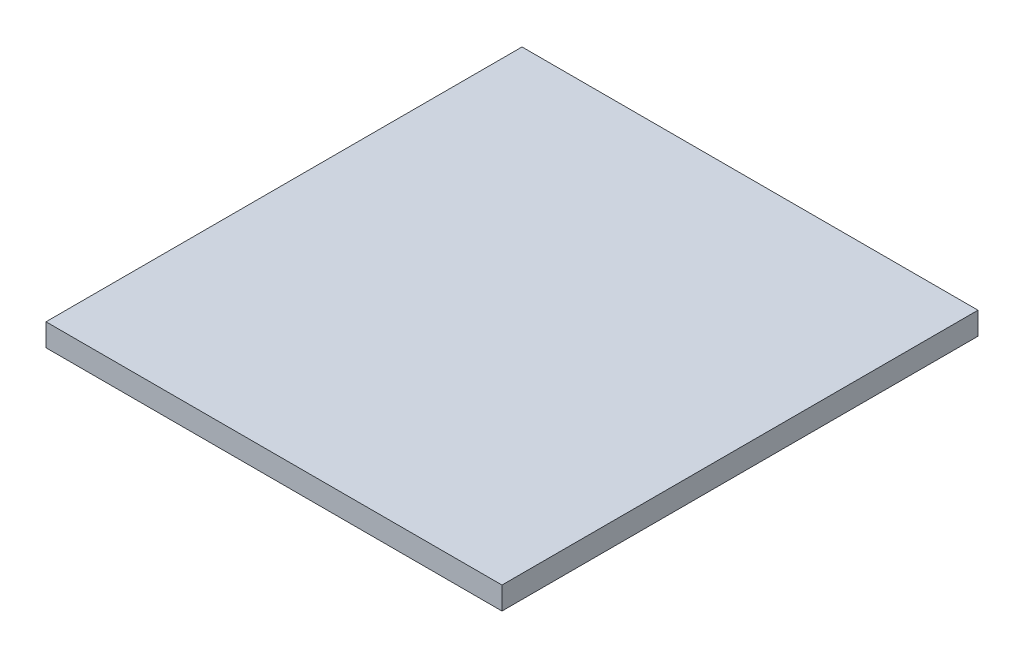
ISO-10303-21;
HEADER;
FILE_DESCRIPTION(('STEP AP214'),'2;1');
FILE_NAME('part.step','',(''),(''),'','','');
FILE_SCHEMA(('AUTOMOTIVE_DESIGN { 1 0 10303 214 1 1 1 1 }'));
ENDSEC;
DATA;
#1=APPLICATION_CONTEXT('core data for automotive mechanical design processes');
#2=APPLICATION_PROTOCOL_DEFINITION('international standard','automotive_design',2000,#1);
#3=PRODUCT_CONTEXT('',#1,'mechanical');
#4=PRODUCT('Part','Part','',(#3));
#5=PRODUCT_RELATED_PRODUCT_CATEGORY('part','',(#4));
#6=PRODUCT_DEFINITION_FORMATION('','',#4);
#7=PRODUCT_DEFINITION_CONTEXT('part definition',#1,'design');
#8=PRODUCT_DEFINITION('design','',#6,#7);
#9=PRODUCT_DEFINITION_SHAPE('','',#8);
#10=(LENGTH_UNIT() NAMED_UNIT(*) SI_UNIT(.MILLI.,.METRE.));
#11=(NAMED_UNIT(*) PLANE_ANGLE_UNIT() SI_UNIT($,.RADIAN.));
#12=(NAMED_UNIT(*) SI_UNIT($,.STERADIAN.) SOLID_ANGLE_UNIT());
#13=UNCERTAINTY_MEASURE_WITH_UNIT(LENGTH_MEASURE(1.E-05),#10,'distance_accuracy_value','');
#14=(GEOMETRIC_REPRESENTATION_CONTEXT(3) GLOBAL_UNCERTAINTY_ASSIGNED_CONTEXT((#13)) GLOBAL_UNIT_ASSIGNED_CONTEXT((#10,
#11,#12)) REPRESENTATION_CONTEXT('',''));
#15=CARTESIAN_POINT('',(0.,0.,0.));
#16=DIRECTION('',(0.,0.,1.));
#17=DIRECTION('',(1.,0.,0.));
#18=AXIS2_PLACEMENT_3D('',#15,#16,#17);
#19=CARTESIAN_POINT('',(325.575632917722,18.,17.0557139599908));
#20=DIRECTION('',(-1.,0.,0.));
#21=DIRECTION('',(0.,0.,1.));
#22=AXIS2_PLACEMENT_3D('',#19,#20,#21);
#23=PLANE('',#22);
#24=DIRECTION('',(0.,0.,-1.));
#25=VECTOR('',#24,1.);
#26=CARTESIAN_POINT('',(325.575632917722,0.,17.0557139599908));
#27=LINE('',#26,#25);
#28=CARTESIAN_POINT('',(325.575632917722,0.,17.0557139599908));
#29=VERTEX_POINT('',#28);
#30=CARTESIAN_POINT('',(325.575632917722,0.,-362.944286040009));
#31=VERTEX_POINT('',#30);
#32=EDGE_CURVE('E98',#29,#31,#27,.T.);
#33=ORIENTED_EDGE('',*,*,#32,.T.);
#34=DIRECTION('',(0.,-1.,0.));
#35=VECTOR('',#34,1.);
#36=CARTESIAN_POINT('',(325.575632917722,18.,-362.944286040009));
#37=LINE('',#36,#35);
#38=CARTESIAN_POINT('',(325.575632917722,18.,-362.944286040009));
#39=VERTEX_POINT('',#38);
#40=EDGE_CURVE('E11',#39,#31,#37,.T.);
#41=ORIENTED_EDGE('',*,*,#40,.F.);
#42=DIRECTION('',(0.,0.,-1.));
#43=VECTOR('',#42,1.);
#44=CARTESIAN_POINT('',(325.575632917722,18.,17.0557139599908));
#45=LINE('',#44,#43);
#46=CARTESIAN_POINT('',(325.575632917722,18.,17.0557139599908));
#47=VERTEX_POINT('',#46);
#48=EDGE_CURVE('E86',#47,#39,#45,.T.);
#49=ORIENTED_EDGE('',*,*,#48,.F.);
#50=DIRECTION('',(0.,-1.,0.));
#51=VECTOR('',#50,1.);
#52=CARTESIAN_POINT('',(325.575632917722,18.,17.0557139599908));
#53=LINE('',#52,#51);
#54=EDGE_CURVE('E94',#47,#29,#53,.T.);
#55=ORIENTED_EDGE('',*,*,#54,.T.);
#56=EDGE_LOOP('',(#33,#41,#49,#55));
#57=FACE_BOUND('',#56,.T.);
#58=ADVANCED_FACE('F35',(#57),#23,.F.);
#59=CARTESIAN_POINT('',(325.575632917722,18.,-362.944286040009));
#60=DIRECTION('',(0.,0.,1.));
#61=DIRECTION('',(1.,0.,0.));
#62=AXIS2_PLACEMENT_3D('',#59,#60,#61);
#63=PLANE('',#62);
#64=DIRECTION('',(-1.,0.,0.));
#65=VECTOR('',#64,1.);
#66=CARTESIAN_POINT('',(325.575632917722,0.,-362.944286040009));
#67=LINE('',#66,#65);
#68=CARTESIAN_POINT('',(-38.4243670822783,0.,-362.944286040009));
#69=VERTEX_POINT('',#68);
#70=EDGE_CURVE('E90',#31,#69,#67,.T.);
#71=ORIENTED_EDGE('',*,*,#70,.T.);
#72=DIRECTION('',(0.,-1.,0.));
#73=VECTOR('',#72,1.);
#74=CARTESIAN_POINT('',(-38.4243670822783,18.,-362.944286040009));
#75=LINE('',#74,#73);
#76=CARTESIAN_POINT('',(-38.4243670822783,18.,-362.944286040009));
#77=VERTEX_POINT('',#76);
#78=EDGE_CURVE('E43',#77,#69,#75,.T.);
#79=ORIENTED_EDGE('',*,*,#78,.F.);
#80=DIRECTION('',(-1.,0.,0.));
#81=VECTOR('',#80,1.);
#82=CARTESIAN_POINT('',(325.575632917722,18.,-362.944286040009));
#83=LINE('',#82,#81);
#84=EDGE_CURVE('E81',#39,#77,#83,.T.);
#85=ORIENTED_EDGE('',*,*,#84,.F.);
#86=ORIENTED_EDGE('',*,*,#40,.T.);
#87=EDGE_LOOP('',(#71,#79,#85,#86));
#88=FACE_BOUND('',#87,.T.);
#89=ADVANCED_FACE('F89',(#88),#63,.F.);
#90=CARTESIAN_POINT('',(-38.4243670822783,18.,17.0557139599909));
#91=DIRECTION('',(1.,0.,0.));
#92=DIRECTION('',(0.,0.,-1.));
#93=AXIS2_PLACEMENT_3D('',#90,#91,#92);
#94=PLANE('',#93);
#95=DIRECTION('',(0.,0.,1.));
#96=VECTOR('',#95,1.);
#97=CARTESIAN_POINT('',(-38.4243670822783,0.,17.0557139599909));
#98=LINE('',#97,#96);
#99=CARTESIAN_POINT('',(-38.4243670822783,0.,17.0557139599909));
#100=VERTEX_POINT('',#99);
#101=EDGE_CURVE('E68',#69,#100,#98,.T.);
#102=ORIENTED_EDGE('',*,*,#101,.T.);
#103=DIRECTION('',(0.,-1.,0.));
#104=VECTOR('',#103,1.);
#105=CARTESIAN_POINT('',(-38.4243670822783,18.,17.0557139599909));
#106=LINE('',#105,#104);
#107=CARTESIAN_POINT('',(-38.4243670822783,18.,17.0557139599909));
#108=VERTEX_POINT('',#107);
#109=EDGE_CURVE('E91',#108,#100,#106,.T.);
#110=ORIENTED_EDGE('',*,*,#109,.F.);
#111=DIRECTION('',(0.,0.,1.));
#112=VECTOR('',#111,1.);
#113=CARTESIAN_POINT('',(-38.4243670822783,18.,17.0557139599909));
#114=LINE('',#113,#112);
#115=EDGE_CURVE('E84',#77,#108,#114,.T.);
#116=ORIENTED_EDGE('',*,*,#115,.F.);
#117=ORIENTED_EDGE('',*,*,#78,.T.);
#118=EDGE_LOOP('',(#102,#110,#116,#117));
#119=FACE_BOUND('',#118,.T.);
#120=ADVANCED_FACE('F92',(#119),#94,.F.);
#121=CARTESIAN_POINT('',(325.575632917722,18.,17.0557139599908));
#122=DIRECTION('',(0.,0.,-1.));
#123=DIRECTION('',(-1.,0.,0.));
#124=AXIS2_PLACEMENT_3D('',#121,#122,#123);
#125=PLANE('',#124);
#126=DIRECTION('',(1.,0.,0.));
#127=VECTOR('',#126,1.);
#128=CARTESIAN_POINT('',(325.575632917722,0.,17.0557139599908));
#129=LINE('',#128,#127);
#130=EDGE_CURVE('E74',#100,#29,#129,.T.);
#131=ORIENTED_EDGE('',*,*,#130,.T.);
#132=ORIENTED_EDGE('',*,*,#54,.F.);
#133=DIRECTION('',(1.,0.,0.));
#134=VECTOR('',#133,1.);
#135=CARTESIAN_POINT('',(325.575632917722,18.,17.0557139599908));
#136=LINE('',#135,#134);
#137=EDGE_CURVE('E51',#108,#47,#136,.T.);
#138=ORIENTED_EDGE('',*,*,#137,.F.);
#139=ORIENTED_EDGE('',*,*,#109,.T.);
#140=EDGE_LOOP('',(#131,#132,#138,#139));
#141=FACE_BOUND('',#140,.T.);
#142=ADVANCED_FACE('F105',(#141),#125,.F.);
#143=CARTESIAN_POINT('',(0.,18.,0.));
#144=DIRECTION('',(0.,1.,0.));
#145=DIRECTION('',(0.,0.,1.));
#146=AXIS2_PLACEMENT_3D('',#143,#144,#145);
#147=PLANE('',#146);
#148=ORIENTED_EDGE('',*,*,#48,.T.);
#149=ORIENTED_EDGE('',*,*,#84,.T.);
#150=ORIENTED_EDGE('',*,*,#115,.T.);
#151=ORIENTED_EDGE('',*,*,#137,.T.);
#152=EDGE_LOOP('',(#148,#149,#150,#151));
#153=FACE_BOUND('',#152,.T.);
#154=ADVANCED_FACE('F82',(#153),#147,.T.);
#155=CARTESIAN_POINT('',(0.,0.,0.));
#156=DIRECTION('',(0.,1.,0.));
#157=DIRECTION('',(0.,0.,1.));
#158=AXIS2_PLACEMENT_3D('',#155,#156,#157);
#159=PLANE('',#158);
#160=ORIENTED_EDGE('',*,*,#32,.F.);
#161=ORIENTED_EDGE('',*,*,#130,.F.);
#162=ORIENTED_EDGE('',*,*,#101,.F.);
#163=ORIENTED_EDGE('',*,*,#70,.F.);
#164=EDGE_LOOP('',(#160,#161,#162,#163));
#165=FACE_BOUND('',#164,.T.);
#166=ADVANCED_FACE('F108',(#165),#159,.F.);
#167=CLOSED_SHELL('',(#58,#89,#120,#142,#154,#166));
#168=MANIFOLD_SOLID_BREP('B2',#167);
#169=ADVANCED_BREP_SHAPE_REPRESENTATION('',(#18,#168),#14);
#170=SHAPE_DEFINITION_REPRESENTATION(#9,#169);
ENDSEC;
END-ISO-10303-21;
